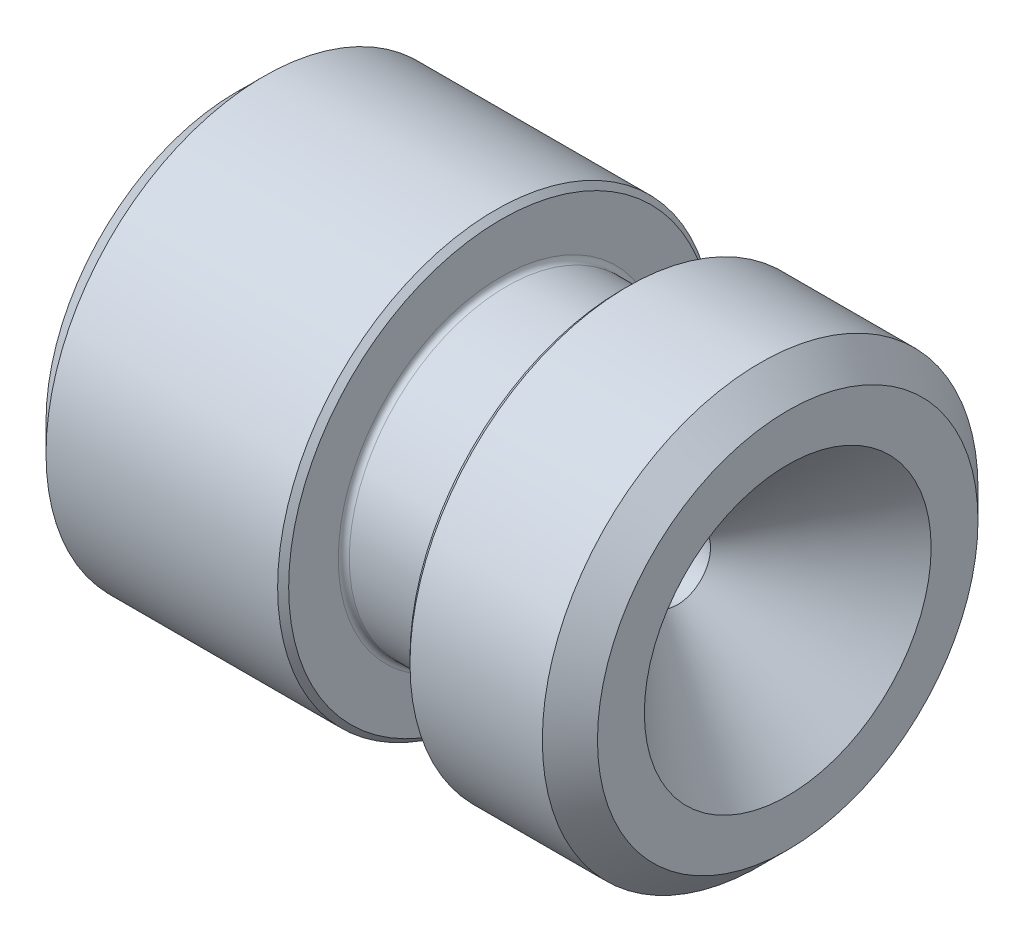
ISO-10303-21;
HEADER;
FILE_DESCRIPTION(('STEP AP214'),'2;1');
FILE_NAME('part.step','',(''),(''),'','','');
FILE_SCHEMA(('AUTOMOTIVE_DESIGN { 1 0 10303 214 1 1 1 1 }'));
ENDSEC;
DATA;
#1=APPLICATION_CONTEXT('core data for automotive mechanical design processes');
#2=APPLICATION_PROTOCOL_DEFINITION('international standard','automotive_design',2000,#1);
#3=PRODUCT_CONTEXT('',#1,'mechanical');
#4=PRODUCT('Part','Part','',(#3));
#5=PRODUCT_RELATED_PRODUCT_CATEGORY('part','',(#4));
#6=PRODUCT_DEFINITION_FORMATION('','',#4);
#7=PRODUCT_DEFINITION_CONTEXT('part definition',#1,'design');
#8=PRODUCT_DEFINITION('design','',#6,#7);
#9=PRODUCT_DEFINITION_SHAPE('','',#8);
#10=(LENGTH_UNIT() NAMED_UNIT(*) SI_UNIT(.MILLI.,.METRE.));
#11=(NAMED_UNIT(*) PLANE_ANGLE_UNIT() SI_UNIT($,.RADIAN.));
#12=(NAMED_UNIT(*) SI_UNIT($,.STERADIAN.) SOLID_ANGLE_UNIT());
#13=UNCERTAINTY_MEASURE_WITH_UNIT(LENGTH_MEASURE(1.E-05),#10,'distance_accuracy_value','');
#14=(GEOMETRIC_REPRESENTATION_CONTEXT(3) GLOBAL_UNCERTAINTY_ASSIGNED_CONTEXT((#13)) GLOBAL_UNIT_ASSIGNED_CONTEXT((#10,
#11,#12)) REPRESENTATION_CONTEXT('',''));
#15=CARTESIAN_POINT('',(0.,0.,0.));
#16=DIRECTION('',(0.,0.,1.));
#17=DIRECTION('',(1.,0.,0.));
#18=AXIS2_PLACEMENT_3D('',#15,#16,#17);
#19=CARTESIAN_POINT('',(0.,0.,0.));
#20=DIRECTION('',(-1.,0.,0.));
#21=DIRECTION('',(0.,0.,1.));
#22=AXIS2_PLACEMENT_3D('',#19,#20,#21);
#23=CONICAL_SURFACE('',#22,0.6,0.261799387799143);
#24=CARTESIAN_POINT('',(-8.,0.,0.));
#25=DIRECTION('',(-1.,0.,0.));
#26=DIRECTION('',(0.,0.,1.));
#27=AXIS2_PLACEMENT_3D('',#24,#25,#26);
#28=CIRCLE('',#27,2.74359353944893);
#29=CARTESIAN_POINT('',(-8.,0.,2.74359353944893));
#30=VERTEX_POINT('',#29);
#31=EDGE_CURVE('E79',#30,#30,#28,.T.);
#32=ORIENTED_EDGE('',*,*,#31,.T.);
#33=EDGE_LOOP('',(#32));
#34=FACE_BOUND('',#33,.T.);
#35=CARTESIAN_POINT('',(0.,0.,0.));
#36=DIRECTION('',(-1.,0.,0.));
#37=DIRECTION('',(0.,0.,1.));
#38=AXIS2_PLACEMENT_3D('',#35,#36,#37);
#39=CIRCLE('',#38,0.6);
#40=CARTESIAN_POINT('',(0.,0.,0.6));
#41=VERTEX_POINT('',#40);
#42=EDGE_CURVE('E85',#41,#41,#39,.T.);
#43=ORIENTED_EDGE('',*,*,#42,.F.);
#44=EDGE_LOOP('',(#43));
#45=FACE_BOUND('',#44,.T.);
#46=ADVANCED_FACE('F34',(#34,#45),#23,.F.);
#47=CARTESIAN_POINT('',(-8.,-2.74359353944893,0.));
#48=DIRECTION('',(-1.,0.,0.));
#49=DIRECTION('',(0.,0.,1.));
#50=AXIS2_PLACEMENT_3D('',#47,#48,#49);
#51=PLANE('',#50);
#52=CARTESIAN_POINT('',(-8.,0.,0.));
#53=DIRECTION('',(-1.,0.,0.));
#54=DIRECTION('',(0.,0.,1.));
#55=AXIS2_PLACEMENT_3D('',#52,#53,#54);
#56=CIRCLE('',#55,3.44999999999999);
#57=CARTESIAN_POINT('',(-8.,0.,3.44999999999999));
#58=VERTEX_POINT('',#57);
#59=EDGE_CURVE('E70',#58,#58,#56,.T.);
#60=ORIENTED_EDGE('',*,*,#59,.T.);
#61=EDGE_LOOP('',(#60));
#62=FACE_BOUND('',#61,.T.);
#63=ORIENTED_EDGE('',*,*,#31,.F.);
#64=EDGE_LOOP('',(#63));
#65=FACE_BOUND('',#64,.T.);
#66=ADVANCED_FACE('F93',(#62,#65),#51,.T.);
#67=CARTESIAN_POINT('',(-24.2985470452268,0.,0.));
#68=DIRECTION('',(-1.,0.,0.));
#69=DIRECTION('',(0.,0.,1.));
#70=AXIS2_PLACEMENT_3D('',#67,#68,#69);
#71=CYLINDRICAL_SURFACE('',#70,3.95);
#72=CARTESIAN_POINT('',(-3.3,0.,0.));
#73=DIRECTION('',(1.,0.,0.));
#74=DIRECTION('',(0.,0.,-1.));
#75=AXIS2_PLACEMENT_3D('',#72,#73,#74);
#76=CIRCLE('',#75,3.95);
#77=CARTESIAN_POINT('',(-3.3,0.,-3.95));
#78=VERTEX_POINT('',#77);
#79=EDGE_CURVE('E42',#78,#78,#76,.F.);
#80=ORIENTED_EDGE('',*,*,#79,.T.);
#81=EDGE_LOOP('',(#80));
#82=FACE_BOUND('',#81,.T.);
#83=CARTESIAN_POINT('',(-7.49999999999999,0.,0.));
#84=DIRECTION('',(-1.,0.,0.));
#85=DIRECTION('',(0.,0.,1.));
#86=AXIS2_PLACEMENT_3D('',#83,#84,#85);
#87=CIRCLE('',#86,3.95);
#88=CARTESIAN_POINT('',(-7.49999999999999,0.,3.95));
#89=VERTEX_POINT('',#88);
#90=EDGE_CURVE('E67',#89,#89,#87,.F.);
#91=ORIENTED_EDGE('',*,*,#90,.T.);
#92=EDGE_LOOP('',(#91));
#93=FACE_BOUND('',#92,.T.);
#94=ADVANCED_FACE('F99',(#82,#93),#71,.T.);
#95=CARTESIAN_POINT('',(-3.2,-3.95,0.));
#96=DIRECTION('',(1.,0.,0.));
#97=DIRECTION('',(0.,0.,-1.));
#98=AXIS2_PLACEMENT_3D('',#95,#96,#97);
#99=PLANE('',#98);
#100=CARTESIAN_POINT('',(-3.2,0.,0.));
#101=DIRECTION('',(1.,0.,0.));
#102=DIRECTION('',(0.,0.,-1.));
#103=AXIS2_PLACEMENT_3D('',#100,#101,#102);
#104=CIRCLE('',#103,3.84999999999999);
#105=CARTESIAN_POINT('',(-3.2,0.,-3.84999999999999));
#106=VERTEX_POINT('',#105);
#107=EDGE_CURVE('E10',#106,#106,#104,.T.);
#108=ORIENTED_EDGE('',*,*,#107,.T.);
#109=EDGE_LOOP('',(#108));
#110=FACE_BOUND('',#109,.T.);
#111=CARTESIAN_POINT('',(-3.2,0.,0.));
#112=DIRECTION('',(1.,0.,0.));
#113=DIRECTION('',(0.,0.,-1.));
#114=AXIS2_PLACEMENT_3D('',#111,#112,#113);
#115=CIRCLE('',#114,2.95);
#116=CARTESIAN_POINT('',(-3.2,0.,-2.95));
#117=VERTEX_POINT('',#116);
#118=EDGE_CURVE('E64',#117,#117,#115,.F.);
#119=ORIENTED_EDGE('',*,*,#118,.T.);
#120=EDGE_LOOP('',(#119));
#121=FACE_BOUND('',#120,.T.);
#122=ADVANCED_FACE('F150',(#110,#121),#99,.T.);
#123=CARTESIAN_POINT('',(-24.2985470452268,0.,0.));
#124=DIRECTION('',(-1.,0.,0.));
#125=DIRECTION('',(0.,0.,1.));
#126=AXIS2_PLACEMENT_3D('',#123,#124,#125);
#127=CYLINDRICAL_SURFACE('',#126,2.85);
#128=CARTESIAN_POINT('',(-3.1,0.,0.));
#129=DIRECTION('',(1.,0.,0.));
#130=DIRECTION('',(0.,0.,-1.));
#131=AXIS2_PLACEMENT_3D('',#128,#129,#130);
#132=CIRCLE('',#131,2.85);
#133=CARTESIAN_POINT('',(-3.1,0.,-2.85));
#134=VERTEX_POINT('',#133);
#135=EDGE_CURVE('E58',#134,#134,#132,.T.);
#136=ORIENTED_EDGE('',*,*,#135,.T.);
#137=EDGE_LOOP('',(#136));
#138=FACE_BOUND('',#137,.T.);
#139=CARTESIAN_POINT('',(-1.1,0.,0.));
#140=DIRECTION('',(-1.,0.,0.));
#141=DIRECTION('',(0.,0.,1.));
#142=AXIS2_PLACEMENT_3D('',#139,#140,#141);
#143=CIRCLE('',#142,2.85);
#144=CARTESIAN_POINT('',(-1.1,0.,2.85));
#145=VERTEX_POINT('',#144);
#146=EDGE_CURVE('E61',#145,#145,#143,.T.);
#147=ORIENTED_EDGE('',*,*,#146,.T.);
#148=EDGE_LOOP('',(#147));
#149=FACE_BOUND('',#148,.T.);
#150=ADVANCED_FACE('F143',(#138,#149),#127,.T.);
#151=CARTESIAN_POINT('',(-1.,-2.85,0.));
#152=DIRECTION('',(-1.,0.,0.));
#153=DIRECTION('',(0.,0.,1.));
#154=AXIS2_PLACEMENT_3D('',#151,#152,#153);
#155=PLANE('',#154);
#156=CARTESIAN_POINT('',(-1.,0.,0.));
#157=DIRECTION('',(-1.,0.,0.));
#158=DIRECTION('',(0.,0.,1.));
#159=AXIS2_PLACEMENT_3D('',#156,#157,#158);
#160=CIRCLE('',#159,3.85000000000001);
#161=CARTESIAN_POINT('',(-1.,0.,3.85000000000001));
#162=VERTEX_POINT('',#161);
#163=EDGE_CURVE('E50',#162,#162,#160,.T.);
#164=ORIENTED_EDGE('',*,*,#163,.T.);
#165=EDGE_LOOP('',(#164));
#166=FACE_BOUND('',#165,.T.);
#167=CARTESIAN_POINT('',(-1.,0.,0.));
#168=DIRECTION('',(-1.,0.,0.));
#169=DIRECTION('',(0.,0.,1.));
#170=AXIS2_PLACEMENT_3D('',#167,#168,#169);
#171=CIRCLE('',#170,2.95);
#172=CARTESIAN_POINT('',(-1.,0.,2.95));
#173=VERTEX_POINT('',#172);
#174=EDGE_CURVE('E55',#173,#173,#171,.F.);
#175=ORIENTED_EDGE('',*,*,#174,.T.);
#176=EDGE_LOOP('',(#175));
#177=FACE_BOUND('',#176,.T.);
#178=ADVANCED_FACE('F139',(#166,#177),#155,.T.);
#179=CARTESIAN_POINT('',(-24.2985470452268,0.,0.));
#180=DIRECTION('',(-1.,0.,0.));
#181=DIRECTION('',(0.,0.,1.));
#182=AXIS2_PLACEMENT_3D('',#179,#180,#181);
#183=CYLINDRICAL_SURFACE('',#182,3.95);
#184=CARTESIAN_POINT('',(-0.900000000000005,0.,0.));
#185=DIRECTION('',(-1.,0.,0.));
#186=DIRECTION('',(0.,0.,1.));
#187=AXIS2_PLACEMENT_3D('',#184,#185,#186);
#188=CIRCLE('',#187,3.95);
#189=CARTESIAN_POINT('',(-0.900000000000005,0.,3.95));
#190=VERTEX_POINT('',#189);
#191=EDGE_CURVE('E46',#190,#190,#188,.F.);
#192=ORIENTED_EDGE('',*,*,#191,.T.);
#193=EDGE_LOOP('',(#192));
#194=FACE_BOUND('',#193,.T.);
#195=CARTESIAN_POINT('',(1.5,0.,0.));
#196=DIRECTION('',(1.,0.,0.));
#197=DIRECTION('',(0.,0.,-1.));
#198=AXIS2_PLACEMENT_3D('',#195,#196,#197);
#199=CIRCLE('',#198,3.95);
#200=CARTESIAN_POINT('',(1.5,0.,-3.95));
#201=VERTEX_POINT('',#200);
#202=EDGE_CURVE('E76',#201,#201,#199,.F.);
#203=ORIENTED_EDGE('',*,*,#202,.T.);
#204=EDGE_LOOP('',(#203));
#205=FACE_BOUND('',#204,.T.);
#206=ADVANCED_FACE('F142',(#194,#205),#183,.T.);
#207=CARTESIAN_POINT('',(2.,-2.59999999999998,0.));
#208=DIRECTION('',(1.,0.,0.));
#209=DIRECTION('',(0.,0.,-1.));
#210=AXIS2_PLACEMENT_3D('',#207,#208,#209);
#211=PLANE('',#210);
#212=CARTESIAN_POINT('',(2.,0.,0.));
#213=DIRECTION('',(1.,0.,0.));
#214=DIRECTION('',(0.,0.,-1.));
#215=AXIS2_PLACEMENT_3D('',#212,#213,#214);
#216=CIRCLE('',#215,3.45);
#217=CARTESIAN_POINT('',(2.,0.,-3.45));
#218=VERTEX_POINT('',#217);
#219=EDGE_CURVE('E73',#218,#218,#216,.T.);
#220=ORIENTED_EDGE('',*,*,#219,.T.);
#221=EDGE_LOOP('',(#220));
#222=FACE_BOUND('',#221,.T.);
#223=CARTESIAN_POINT('',(2.,0.,0.));
#224=DIRECTION('',(-1.,0.,0.));
#225=DIRECTION('',(0.,0.,1.));
#226=AXIS2_PLACEMENT_3D('',#223,#224,#225);
#227=CIRCLE('',#226,2.59999999999998);
#228=CARTESIAN_POINT('',(2.,0.,2.59999999999998));
#229=VERTEX_POINT('',#228);
#230=EDGE_CURVE('E82',#229,#229,#227,.T.);
#231=ORIENTED_EDGE('',*,*,#230,.T.);
#232=EDGE_LOOP('',(#231));
#233=FACE_BOUND('',#232,.T.);
#234=ADVANCED_FACE('F189',(#222,#233),#211,.T.);
#235=CARTESIAN_POINT('',(2.,0.,0.));
#236=DIRECTION('',(1.,0.,0.));
#237=DIRECTION('',(0.,0.,-1.));
#238=AXIS2_PLACEMENT_3D('',#235,#236,#237);
#239=CONICAL_SURFACE('',#238,2.59999999999998,0.785398163397443);
#240=ORIENTED_EDGE('',*,*,#42,.T.);
#241=EDGE_LOOP('',(#240));
#242=FACE_BOUND('',#241,.T.);
#243=ORIENTED_EDGE('',*,*,#230,.F.);
#244=EDGE_LOOP('',(#243));
#245=FACE_BOUND('',#244,.T.);
#246=ADVANCED_FACE('F89',(#242,#245),#239,.F.);
#247=CARTESIAN_POINT('',(1.5,0.,0.));
#248=DIRECTION('',(-1.,0.,0.));
#249=DIRECTION('',(0.,0.,1.));
#250=AXIS2_PLACEMENT_3D('',#247,#248,#249);
#251=CONICAL_SURFACE('',#250,3.95,0.785398163397447);
#252=ORIENTED_EDGE('',*,*,#219,.F.);
#253=EDGE_LOOP('',(#252));
#254=FACE_BOUND('',#253,.T.);
#255=ORIENTED_EDGE('',*,*,#202,.F.);
#256=EDGE_LOOP('',(#255));
#257=FACE_BOUND('',#256,.T.);
#258=ADVANCED_FACE('F105',(#254,#257),#251,.T.);
#259=CARTESIAN_POINT('',(-8.,0.,0.));
#260=DIRECTION('',(1.,0.,0.));
#261=DIRECTION('',(0.,0.,-1.));
#262=AXIS2_PLACEMENT_3D('',#259,#260,#261);
#263=CONICAL_SURFACE('',#262,3.44999999999999,0.785398163397445);
#264=ORIENTED_EDGE('',*,*,#90,.F.);
#265=EDGE_LOOP('',(#264));
#266=FACE_BOUND('',#265,.T.);
#267=ORIENTED_EDGE('',*,*,#59,.F.);
#268=EDGE_LOOP('',(#267));
#269=FACE_BOUND('',#268,.T.);
#270=ADVANCED_FACE('F111',(#266,#269),#263,.T.);
#271=CARTESIAN_POINT('',(-3.1,0.,0.));
#272=DIRECTION('',(1.,0.,0.));
#273=DIRECTION('',(0.,0.,-1.));
#274=AXIS2_PLACEMENT_3D('',#271,#272,#273);
#275=TOROIDAL_SURFACE('',#274,2.95,0.1);
#276=ORIENTED_EDGE('',*,*,#135,.F.);
#277=EDGE_LOOP('',(#276));
#278=FACE_BOUND('',#277,.T.);
#279=ORIENTED_EDGE('',*,*,#118,.F.);
#280=EDGE_LOOP('',(#279));
#281=FACE_BOUND('',#280,.T.);
#282=ADVANCED_FACE('F118',(#278,#281),#275,.F.);
#283=CARTESIAN_POINT('',(-1.1,0.,0.));
#284=DIRECTION('',(-1.,0.,0.));
#285=DIRECTION('',(0.,0.,1.));
#286=AXIS2_PLACEMENT_3D('',#283,#284,#285);
#287=TOROIDAL_SURFACE('',#286,2.95,0.1);
#288=ORIENTED_EDGE('',*,*,#174,.F.);
#289=EDGE_LOOP('',(#288));
#290=FACE_BOUND('',#289,.T.);
#291=ORIENTED_EDGE('',*,*,#146,.F.);
#292=EDGE_LOOP('',(#291));
#293=FACE_BOUND('',#292,.T.);
#294=ADVANCED_FACE('F122',(#290,#293),#287,.F.);
#295=CARTESIAN_POINT('',(-1.,0.,0.));
#296=DIRECTION('',(1.,0.,0.));
#297=DIRECTION('',(0.,0.,-1.));
#298=AXIS2_PLACEMENT_3D('',#295,#296,#297);
#299=CONICAL_SURFACE('',#298,3.85000000000001,0.785398163397435);
#300=ORIENTED_EDGE('',*,*,#191,.F.);
#301=EDGE_LOOP('',(#300));
#302=FACE_BOUND('',#301,.T.);
#303=ORIENTED_EDGE('',*,*,#163,.F.);
#304=EDGE_LOOP('',(#303));
#305=FACE_BOUND('',#304,.T.);
#306=ADVANCED_FACE('F125',(#302,#305),#299,.T.);
#307=CARTESIAN_POINT('',(-3.3,0.,0.));
#308=DIRECTION('',(-1.,0.,0.));
#309=DIRECTION('',(0.,0.,1.));
#310=AXIS2_PLACEMENT_3D('',#307,#308,#309);
#311=CONICAL_SURFACE('',#310,3.95,0.785398163397466);
#312=ORIENTED_EDGE('',*,*,#107,.F.);
#313=EDGE_LOOP('',(#312));
#314=FACE_BOUND('',#313,.T.);
#315=ORIENTED_EDGE('',*,*,#79,.F.);
#316=EDGE_LOOP('',(#315));
#317=FACE_BOUND('',#316,.T.);
#318=ADVANCED_FACE('F37',(#314,#317),#311,.T.);
#319=CLOSED_SHELL('',(#46,#66,#94,#122,#150,#178,#206,#234,#246,#258,#270,#282,#294,#306,#318));
#320=MANIFOLD_SOLID_BREP('B2',#319);
#321=ADVANCED_BREP_SHAPE_REPRESENTATION('',(#18,#320),#14);
#322=SHAPE_DEFINITION_REPRESENTATION(#9,#321);
ENDSEC;
END-ISO-10303-21;
